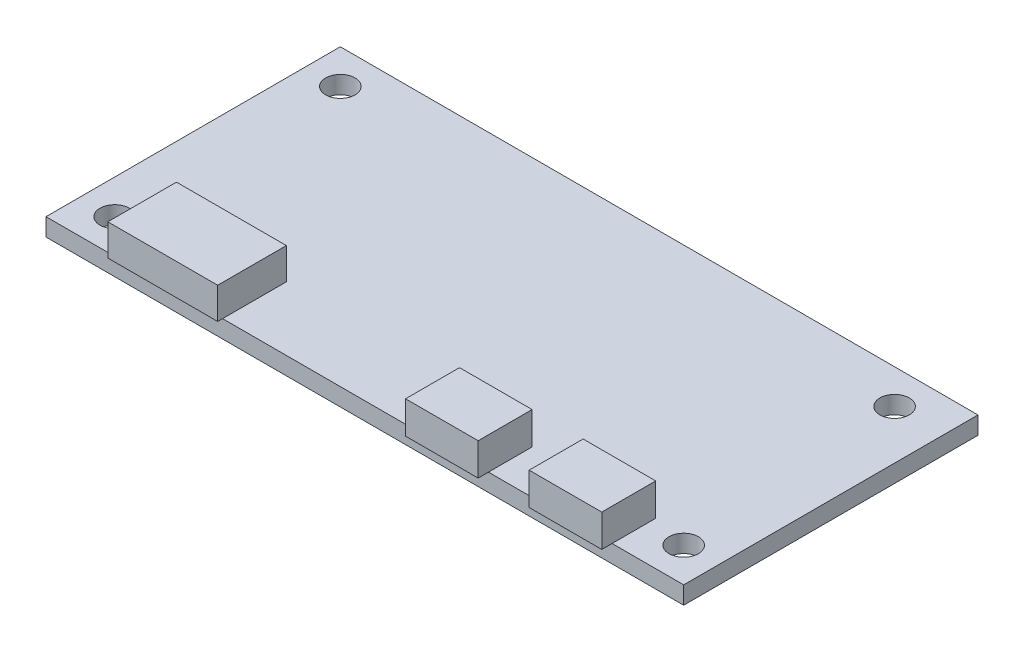
ISO-10303-21;
HEADER;
FILE_DESCRIPTION(('STEP AP214'),'2;1');
FILE_NAME('part.step','',(''),(''),'','','');
FILE_SCHEMA(('AUTOMOTIVE_DESIGN { 1 0 10303 214 1 1 1 1 }'));
ENDSEC;
DATA;
#1=APPLICATION_CONTEXT('core data for automotive mechanical design processes');
#2=APPLICATION_PROTOCOL_DEFINITION('international standard','automotive_design',2000,#1);
#3=PRODUCT_CONTEXT('',#1,'mechanical');
#4=PRODUCT('Part','Part','',(#3));
#5=PRODUCT_RELATED_PRODUCT_CATEGORY('part','',(#4));
#6=PRODUCT_DEFINITION_FORMATION('','',#4);
#7=PRODUCT_DEFINITION_CONTEXT('part definition',#1,'design');
#8=PRODUCT_DEFINITION('design','',#6,#7);
#9=PRODUCT_DEFINITION_SHAPE('','',#8);
#10=(LENGTH_UNIT() NAMED_UNIT(*) SI_UNIT(.MILLI.,.METRE.));
#11=(NAMED_UNIT(*) PLANE_ANGLE_UNIT() SI_UNIT($,.RADIAN.));
#12=(NAMED_UNIT(*) SI_UNIT($,.STERADIAN.) SOLID_ANGLE_UNIT());
#13=UNCERTAINTY_MEASURE_WITH_UNIT(LENGTH_MEASURE(1.E-05),#10,'distance_accuracy_value','');
#14=(GEOMETRIC_REPRESENTATION_CONTEXT(3) GLOBAL_UNCERTAINTY_ASSIGNED_CONTEXT((#13)) GLOBAL_UNIT_ASSIGNED_CONTEXT((#10,
#11,#12)) REPRESENTATION_CONTEXT('',''));
#15=CARTESIAN_POINT('',(0.,0.,0.));
#16=DIRECTION('',(0.,0.,1.));
#17=DIRECTION('',(1.,0.,0.));
#18=AXIS2_PLACEMENT_3D('',#15,#16,#17);
#19=CARTESIAN_POINT('',(0.,0.,0.));
#20=DIRECTION('',(0.,-1.,0.));
#21=DIRECTION('',(0.,0.,-1.));
#22=AXIS2_PLACEMENT_3D('',#19,#20,#21);
#23=PLANE('',#22);
#24=CARTESIAN_POINT('',(32.7195053440274,0.,-13.4961734693878));
#25=DIRECTION('',(0.,1.,0.));
#26=DIRECTION('',(0.,0.,1.));
#27=AXIS2_PLACEMENT_3D('',#24,#25,#26);
#28=CIRCLE('',#27,1.5);
#29=CARTESIAN_POINT('',(32.7195053440274,0.,-11.9961734693877));
#30=VERTEX_POINT('',#29);
#31=EDGE_CURVE('E338',#30,#30,#28,.T.);
#32=ORIENTED_EDGE('',*,*,#31,.F.);
#33=EDGE_LOOP('',(#32));
#34=FACE_BOUND('',#33,.T.);
#35=CARTESIAN_POINT('',(34.2232142857143,0.,9.50382653061225));
#36=DIRECTION('',(0.,1.,0.));
#37=DIRECTION('',(0.,0.,1.));
#38=AXIS2_PLACEMENT_3D('',#35,#36,#37);
#39=CIRCLE('',#38,1.5);
#40=CARTESIAN_POINT('',(34.2232142857143,0.,11.0038265306123));
#41=VERTEX_POINT('',#40);
#42=EDGE_CURVE('E332',#41,#41,#39,.T.);
#43=ORIENTED_EDGE('',*,*,#42,.F.);
#44=EDGE_LOOP('',(#43));
#45=FACE_BOUND('',#44,.T.);
#46=CARTESIAN_POINT('',(-23.7767857142857,0.,9.50382653061225));
#47=DIRECTION('',(0.,1.,0.));
#48=DIRECTION('',(0.,0.,1.));
#49=AXIS2_PLACEMENT_3D('',#46,#47,#48);
#50=CIRCLE('',#49,1.5);
#51=CARTESIAN_POINT('',(-23.7767857142857,0.,11.0038265306122));
#52=VERTEX_POINT('',#51);
#53=EDGE_CURVE('E326',#52,#52,#50,.T.);
#54=ORIENTED_EDGE('',*,*,#53,.F.);
#55=EDGE_LOOP('',(#54));
#56=FACE_BOUND('',#55,.T.);
#57=CARTESIAN_POINT('',(-23.7767857142857,0.,-13.4961734693878));
#58=DIRECTION('',(0.,1.,0.));
#59=DIRECTION('',(0.,0.,1.));
#60=AXIS2_PLACEMENT_3D('',#57,#58,#59);
#61=CIRCLE('',#60,1.5);
#62=CARTESIAN_POINT('',(-23.7767857142857,0.,-11.9961734693877));
#63=VERTEX_POINT('',#62);
#64=EDGE_CURVE('E322',#63,#63,#61,.T.);
#65=ORIENTED_EDGE('',*,*,#64,.F.);
#66=EDGE_LOOP('',(#65));
#67=FACE_BOUND('',#66,.T.);
#68=DIRECTION('',(0.,0.,1.));
#69=VECTOR('',#68,1.);
#70=CARTESIAN_POINT('',(23.0232142857143,0.,8.55382653061225));
#71=LINE('',#70,#69);
#72=CARTESIAN_POINT('',(23.0232142857143,0.,8.55382653061225));
#73=VERTEX_POINT('',#72);
#74=CARTESIAN_POINT('',(23.0232142857143,0.,13.0038265306122));
#75=VERTEX_POINT('',#74);
#76=EDGE_CURVE('E112',#73,#75,#71,.T.);
#77=ORIENTED_EDGE('',*,*,#76,.F.);
#78=DIRECTION('',(-1.,0.,0.));
#79=VECTOR('',#78,1.);
#80=CARTESIAN_POINT('',(23.0232142857143,0.,8.55382653061225));
#81=LINE('',#80,#79);
#82=CARTESIAN_POINT('',(30.4232142857143,0.,8.55382653061225));
#83=VERTEX_POINT('',#82);
#84=EDGE_CURVE('E116',#83,#73,#81,.T.);
#85=ORIENTED_EDGE('',*,*,#84,.F.);
#86=DIRECTION('',(0.,0.,-1.));
#87=VECTOR('',#86,1.);
#88=CARTESIAN_POINT('',(30.4232142857143,0.,8.55382653061225));
#89=LINE('',#88,#87);
#90=CARTESIAN_POINT('',(30.4232142857143,0.,13.0038265306122));
#91=VERTEX_POINT('',#90);
#92=EDGE_CURVE('E385',#91,#83,#89,.T.);
#93=ORIENTED_EDGE('',*,*,#92,.F.);
#94=DIRECTION('',(1.,0.,0.));
#95=VECTOR('',#94,1.);
#96=CARTESIAN_POINT('',(-27.2767857142857,0.,13.0038265306122));
#97=LINE('',#96,#95);
#98=CARTESIAN_POINT('',(37.7232142857143,0.,13.0038265306122));
#99=VERTEX_POINT('',#98);
#100=EDGE_CURVE('E344',#91,#99,#97,.T.);
#101=ORIENTED_EDGE('',*,*,#100,.T.);
#102=DIRECTION('',(0.,0.,1.));
#103=VECTOR('',#102,1.);
#104=CARTESIAN_POINT('',(37.7232142857143,0.,-16.9961734693878));
#105=LINE('',#104,#103);
#106=CARTESIAN_POINT('',(37.7232142857143,0.,-16.9961734693878));
#107=VERTEX_POINT('',#106);
#108=EDGE_CURVE('E361',#107,#99,#105,.T.);
#109=ORIENTED_EDGE('',*,*,#108,.F.);
#110=DIRECTION('',(1.,0.,0.));
#111=VECTOR('',#110,1.);
#112=CARTESIAN_POINT('',(-27.2767857142857,0.,-16.9961734693878));
#113=LINE('',#112,#111);
#114=CARTESIAN_POINT('',(-27.2767857142857,0.,-16.9961734693878));
#115=VERTEX_POINT('',#114);
#116=EDGE_CURVE('E365',#115,#107,#113,.T.);
#117=ORIENTED_EDGE('',*,*,#116,.F.);
#118=DIRECTION('',(0.,0.,1.));
#119=VECTOR('',#118,1.);
#120=CARTESIAN_POINT('',(-27.2767857142857,0.,-16.9961734693878));
#121=LINE('',#120,#119);
#122=CARTESIAN_POINT('',(-27.2767857142857,0.,13.0038265306122));
#123=VERTEX_POINT('',#122);
#124=EDGE_CURVE('E351',#115,#123,#121,.T.);
#125=ORIENTED_EDGE('',*,*,#124,.T.);
#126=CARTESIAN_POINT('',(-20.4767857142857,0.,13.0038265306122));
#127=VERTEX_POINT('',#126);
#128=EDGE_CURVE('E358',#123,#127,#97,.T.);
#129=ORIENTED_EDGE('',*,*,#128,.T.);
#130=DIRECTION('',(0.,0.,1.));
#131=VECTOR('',#130,1.);
#132=CARTESIAN_POINT('',(-20.4767857142857,0.,6.50382653061225));
#133=LINE('',#132,#131);
#134=CARTESIAN_POINT('',(-20.4767857142857,0.,6.50382653061225));
#135=VERTEX_POINT('',#134);
#136=EDGE_CURVE('E303',#135,#127,#133,.T.);
#137=ORIENTED_EDGE('',*,*,#136,.F.);
#138=DIRECTION('',(-1.,0.,0.));
#139=VECTOR('',#138,1.);
#140=CARTESIAN_POINT('',(-20.4767857142857,0.,6.50382653061225));
#141=LINE('',#140,#139);
#142=CARTESIAN_POINT('',(-9.27678571428569,0.,6.50382653061225));
#143=VERTEX_POINT('',#142);
#144=EDGE_CURVE('E296',#143,#135,#141,.T.);
#145=ORIENTED_EDGE('',*,*,#144,.F.);
#146=DIRECTION('',(0.,0.,-1.));
#147=VECTOR('',#146,1.);
#148=CARTESIAN_POINT('',(-9.27678571428569,0.,6.50382653061225));
#149=LINE('',#148,#147);
#150=CARTESIAN_POINT('',(-9.27678571428569,0.,13.0038265306122));
#151=VERTEX_POINT('',#150);
#152=EDGE_CURVE('E12',#151,#143,#149,.T.);
#153=ORIENTED_EDGE('',*,*,#152,.F.);
#154=CARTESIAN_POINT('',(10.4232142857143,0.,13.0038265306122));
#155=VERTEX_POINT('',#154);
#156=EDGE_CURVE('E395',#151,#155,#97,.T.);
#157=ORIENTED_EDGE('',*,*,#156,.T.);
#158=DIRECTION('',(0.,0.,1.));
#159=VECTOR('',#158,1.);
#160=CARTESIAN_POINT('',(10.4232142857143,0.,8.55382653061225));
#161=LINE('',#160,#159);
#162=CARTESIAN_POINT('',(10.4232142857143,0.,8.55382653061225));
#163=VERTEX_POINT('',#162);
#164=EDGE_CURVE('E254',#163,#155,#161,.T.);
#165=ORIENTED_EDGE('',*,*,#164,.F.);
#166=DIRECTION('',(-1.,0.,0.));
#167=VECTOR('',#166,1.);
#168=CARTESIAN_POINT('',(10.4232142857143,0.,8.55382653061225));
#169=LINE('',#168,#167);
#170=CARTESIAN_POINT('',(17.8232142857143,0.,8.55382653061225));
#171=VERTEX_POINT('',#170);
#172=EDGE_CURVE('E264',#171,#163,#169,.T.);
#173=ORIENTED_EDGE('',*,*,#172,.F.);
#174=DIRECTION('',(0.,0.,-1.));
#175=VECTOR('',#174,1.);
#176=CARTESIAN_POINT('',(17.8232142857143,0.,8.55382653061225));
#177=LINE('',#176,#175);
#178=CARTESIAN_POINT('',(17.8232142857143,0.,13.0038265306122));
#179=VERTEX_POINT('',#178);
#180=EDGE_CURVE('E274',#179,#171,#177,.T.);
#181=ORIENTED_EDGE('',*,*,#180,.F.);
#182=EDGE_CURVE('E388',#179,#75,#97,.T.);
#183=ORIENTED_EDGE('',*,*,#182,.T.);
#184=EDGE_LOOP('',(#77,#85,#93,#101,#109,#117,#125,#129,#137,#145,#153,#157,#165,#173,#181,#183));
#185=FACE_BOUND('',#184,.T.);
#186=ADVANCED_FACE('F94',(#34,#45,#56,#67,#185),#23,.F.);
#187=CARTESIAN_POINT('',(-27.2767857142857,-1.8,13.0038265306122));
#188=DIRECTION('',(0.,0.,1.));
#189=DIRECTION('',(1.,0.,0.));
#190=AXIS2_PLACEMENT_3D('',#187,#188,#189);
#191=PLANE('',#190);
#192=ORIENTED_EDGE('',*,*,#128,.F.);
#193=DIRECTION('',(0.,1.,0.));
#194=VECTOR('',#193,1.);
#195=CARTESIAN_POINT('',(-27.2767857142857,-1.8,13.0038265306122));
#196=LINE('',#195,#194);
#197=CARTESIAN_POINT('',(-27.2767857142857,-1.8,13.0038265306122));
#198=VERTEX_POINT('',#197);
#199=EDGE_CURVE('E103',#198,#123,#196,.T.);
#200=ORIENTED_EDGE('',*,*,#199,.F.);
#201=DIRECTION('',(1.,0.,0.));
#202=VECTOR('',#201,1.);
#203=CARTESIAN_POINT('',(-27.2767857142857,-1.8,13.0038265306122));
#204=LINE('',#203,#202);
#205=CARTESIAN_POINT('',(37.7232142857143,-1.8,13.0038265306122));
#206=VERTEX_POINT('',#205);
#207=EDGE_CURVE('E347',#198,#206,#204,.T.);
#208=ORIENTED_EDGE('',*,*,#207,.T.);
#209=DIRECTION('',(0.,1.,0.));
#210=VECTOR('',#209,1.);
#211=CARTESIAN_POINT('',(37.7232142857143,-1.8,13.0038265306122));
#212=LINE('',#211,#210);
#213=EDGE_CURVE('E98',#206,#99,#212,.T.);
#214=ORIENTED_EDGE('',*,*,#213,.T.);
#215=ORIENTED_EDGE('',*,*,#100,.F.);
#216=EDGE_CURVE('E387',#75,#91,#97,.T.);
#217=ORIENTED_EDGE('',*,*,#216,.F.);
#218=ORIENTED_EDGE('',*,*,#182,.F.);
#219=EDGE_CURVE('E392',#155,#179,#97,.T.);
#220=ORIENTED_EDGE('',*,*,#219,.F.);
#221=ORIENTED_EDGE('',*,*,#156,.F.);
#222=EDGE_CURVE('E362',#127,#151,#97,.T.);
#223=ORIENTED_EDGE('',*,*,#222,.F.);
#224=EDGE_LOOP('',(#192,#200,#208,#214,#215,#217,#218,#220,#221,#223));
#225=FACE_BOUND('',#224,.T.);
#226=ADVANCED_FACE('F96',(#225),#191,.T.);
#227=CARTESIAN_POINT('',(-27.2767857142857,-1.8,-16.9961734693878));
#228=DIRECTION('',(-1.,0.,0.));
#229=DIRECTION('',(0.,0.,1.));
#230=AXIS2_PLACEMENT_3D('',#227,#228,#229);
#231=PLANE('',#230);
#232=ORIENTED_EDGE('',*,*,#124,.F.);
#233=DIRECTION('',(0.,1.,0.));
#234=VECTOR('',#233,1.);
#235=CARTESIAN_POINT('',(-27.2767857142857,-1.8,-16.9961734693878));
#236=LINE('',#235,#234);
#237=CARTESIAN_POINT('',(-27.2767857142857,-1.8,-16.9961734693878));
#238=VERTEX_POINT('',#237);
#239=EDGE_CURVE('E370',#238,#115,#236,.T.);
#240=ORIENTED_EDGE('',*,*,#239,.F.);
#241=DIRECTION('',(0.,0.,1.));
#242=VECTOR('',#241,1.);
#243=CARTESIAN_POINT('',(-27.2767857142857,-1.8,-16.9961734693878));
#244=LINE('',#243,#242);
#245=EDGE_CURVE('E355',#238,#198,#244,.T.);
#246=ORIENTED_EDGE('',*,*,#245,.T.);
#247=ORIENTED_EDGE('',*,*,#199,.T.);
#248=EDGE_LOOP('',(#232,#240,#246,#247));
#249=FACE_BOUND('',#248,.T.);
#250=ADVANCED_FACE('F442',(#249),#231,.T.);
#251=CARTESIAN_POINT('',(-27.2767857142857,-1.8,-16.9961734693878));
#252=DIRECTION('',(0.,0.,1.));
#253=DIRECTION('',(1.,0.,0.));
#254=AXIS2_PLACEMENT_3D('',#251,#252,#253);
#255=PLANE('',#254);
#256=ORIENTED_EDGE('',*,*,#116,.T.);
#257=DIRECTION('',(0.,1.,0.));
#258=VECTOR('',#257,1.);
#259=CARTESIAN_POINT('',(37.7232142857143,-1.8,-16.9961734693878));
#260=LINE('',#259,#258);
#261=CARTESIAN_POINT('',(37.7232142857143,-1.8,-16.9961734693878));
#262=VERTEX_POINT('',#261);
#263=EDGE_CURVE('E371',#262,#107,#260,.T.);
#264=ORIENTED_EDGE('',*,*,#263,.F.);
#265=DIRECTION('',(1.,0.,0.));
#266=VECTOR('',#265,1.);
#267=CARTESIAN_POINT('',(-27.2767857142857,-1.8,-16.9961734693878));
#268=LINE('',#267,#266);
#269=EDGE_CURVE('E353',#238,#262,#268,.T.);
#270=ORIENTED_EDGE('',*,*,#269,.F.);
#271=ORIENTED_EDGE('',*,*,#239,.T.);
#272=EDGE_LOOP('',(#256,#264,#270,#271));
#273=FACE_BOUND('',#272,.T.);
#274=ADVANCED_FACE('F451',(#273),#255,.F.);
#275=CARTESIAN_POINT('',(37.7232142857143,-1.8,-16.9961734693878));
#276=DIRECTION('',(-1.,0.,0.));
#277=DIRECTION('',(0.,0.,1.));
#278=AXIS2_PLACEMENT_3D('',#275,#276,#277);
#279=PLANE('',#278);
#280=ORIENTED_EDGE('',*,*,#108,.T.);
#281=ORIENTED_EDGE('',*,*,#213,.F.);
#282=DIRECTION('',(0.,0.,1.));
#283=VECTOR('',#282,1.);
#284=CARTESIAN_POINT('',(37.7232142857143,-1.8,-16.9961734693878));
#285=LINE('',#284,#283);
#286=EDGE_CURVE('E350',#262,#206,#285,.T.);
#287=ORIENTED_EDGE('',*,*,#286,.F.);
#288=ORIENTED_EDGE('',*,*,#263,.T.);
#289=EDGE_LOOP('',(#280,#281,#287,#288));
#290=FACE_BOUND('',#289,.T.);
#291=ADVANCED_FACE('F382',(#290),#279,.F.);
#292=CARTESIAN_POINT('',(0.,-1.8,0.));
#293=DIRECTION('',(0.,-1.,0.));
#294=DIRECTION('',(0.,0.,-1.));
#295=AXIS2_PLACEMENT_3D('',#292,#293,#294);
#296=PLANE('',#295);
#297=CARTESIAN_POINT('',(-23.7767857142857,-1.8,-13.4961734693878));
#298=DIRECTION('',(0.,1.,0.));
#299=DIRECTION('',(0.,0.,1.));
#300=AXIS2_PLACEMENT_3D('',#297,#298,#299);
#301=CIRCLE('',#300,1.5);
#302=CARTESIAN_POINT('',(-23.7767857142857,-1.8,-11.9961734693877));
#303=VERTEX_POINT('',#302);
#304=EDGE_CURVE('E323',#303,#303,#301,.T.);
#305=ORIENTED_EDGE('',*,*,#304,.T.);
#306=EDGE_LOOP('',(#305));
#307=FACE_BOUND('',#306,.T.);
#308=CARTESIAN_POINT('',(-23.7767857142857,-1.8,9.50382653061225));
#309=DIRECTION('',(0.,1.,0.));
#310=DIRECTION('',(0.,0.,1.));
#311=AXIS2_PLACEMENT_3D('',#308,#309,#310);
#312=CIRCLE('',#311,1.5);
#313=CARTESIAN_POINT('',(-23.7767857142857,-1.8,11.0038265306122));
#314=VERTEX_POINT('',#313);
#315=EDGE_CURVE('E329',#314,#314,#312,.T.);
#316=ORIENTED_EDGE('',*,*,#315,.T.);
#317=EDGE_LOOP('',(#316));
#318=FACE_BOUND('',#317,.T.);
#319=CARTESIAN_POINT('',(34.2232142857143,-1.8,9.50382653061225));
#320=DIRECTION('',(0.,1.,0.));
#321=DIRECTION('',(0.,0.,1.));
#322=AXIS2_PLACEMENT_3D('',#319,#320,#321);
#323=CIRCLE('',#322,1.5);
#324=CARTESIAN_POINT('',(34.2232142857143,-1.8,11.0038265306123));
#325=VERTEX_POINT('',#324);
#326=EDGE_CURVE('E335',#325,#325,#323,.T.);
#327=ORIENTED_EDGE('',*,*,#326,.T.);
#328=EDGE_LOOP('',(#327));
#329=FACE_BOUND('',#328,.T.);
#330=CARTESIAN_POINT('',(32.7195053440274,-1.8,-13.4961734693878));
#331=DIRECTION('',(0.,1.,0.));
#332=DIRECTION('',(0.,0.,1.));
#333=AXIS2_PLACEMENT_3D('',#330,#331,#332);
#334=CIRCLE('',#333,1.5);
#335=CARTESIAN_POINT('',(32.7195053440274,-1.8,-11.9961734693877));
#336=VERTEX_POINT('',#335);
#337=EDGE_CURVE('E341',#336,#336,#334,.T.);
#338=ORIENTED_EDGE('',*,*,#337,.T.);
#339=EDGE_LOOP('',(#338));
#340=FACE_BOUND('',#339,.T.);
#341=ORIENTED_EDGE('',*,*,#207,.F.);
#342=ORIENTED_EDGE('',*,*,#245,.F.);
#343=ORIENTED_EDGE('',*,*,#269,.T.);
#344=ORIENTED_EDGE('',*,*,#286,.T.);
#345=EDGE_LOOP('',(#341,#342,#343,#344));
#346=FACE_BOUND('',#345,.T.);
#347=ADVANCED_FACE('F447',(#307,#318,#329,#340,#346),#296,.T.);
#348=CARTESIAN_POINT('',(32.7195053440274,-1.8,-13.4961734693878));
#349=DIRECTION('',(0.,1.,0.));
#350=DIRECTION('',(0.,0.,1.));
#351=AXIS2_PLACEMENT_3D('',#348,#349,#350);
#352=CYLINDRICAL_SURFACE('',#351,1.5);
#353=ORIENTED_EDGE('',*,*,#337,.F.);
#354=EDGE_LOOP('',(#353));
#355=FACE_BOUND('',#354,.T.);
#356=ORIENTED_EDGE('',*,*,#31,.T.);
#357=EDGE_LOOP('',(#356));
#358=FACE_BOUND('',#357,.T.);
#359=ADVANCED_FACE('F459',(#355,#358),#352,.F.);
#360=CARTESIAN_POINT('',(34.2232142857143,-1.8,9.50382653061225));
#361=DIRECTION('',(0.,1.,0.));
#362=DIRECTION('',(0.,0.,1.));
#363=AXIS2_PLACEMENT_3D('',#360,#361,#362);
#364=CYLINDRICAL_SURFACE('',#363,1.5);
#365=ORIENTED_EDGE('',*,*,#326,.F.);
#366=EDGE_LOOP('',(#365));
#367=FACE_BOUND('',#366,.T.);
#368=ORIENTED_EDGE('',*,*,#42,.T.);
#369=EDGE_LOOP('',(#368));
#370=FACE_BOUND('',#369,.T.);
#371=ADVANCED_FACE('F464',(#367,#370),#364,.F.);
#372=CARTESIAN_POINT('',(-23.7767857142857,-1.8,9.50382653061225));
#373=DIRECTION('',(0.,1.,0.));
#374=DIRECTION('',(0.,0.,1.));
#375=AXIS2_PLACEMENT_3D('',#372,#373,#374);
#376=CYLINDRICAL_SURFACE('',#375,1.5);
#377=ORIENTED_EDGE('',*,*,#315,.F.);
#378=EDGE_LOOP('',(#377));
#379=FACE_BOUND('',#378,.T.);
#380=ORIENTED_EDGE('',*,*,#53,.T.);
#381=EDGE_LOOP('',(#380));
#382=FACE_BOUND('',#381,.T.);
#383=ADVANCED_FACE('F480',(#379,#382),#376,.F.);
#384=CARTESIAN_POINT('',(-23.7767857142857,-1.8,-13.4961734693878));
#385=DIRECTION('',(0.,1.,0.));
#386=DIRECTION('',(0.,0.,1.));
#387=AXIS2_PLACEMENT_3D('',#384,#385,#386);
#388=CYLINDRICAL_SURFACE('',#387,1.5);
#389=ORIENTED_EDGE('',*,*,#304,.F.);
#390=EDGE_LOOP('',(#389));
#391=FACE_BOUND('',#390,.T.);
#392=ORIENTED_EDGE('',*,*,#64,.T.);
#393=EDGE_LOOP('',(#392));
#394=FACE_BOUND('',#393,.T.);
#395=ADVANCED_FACE('F488',(#391,#394),#388,.F.);
#396=CARTESIAN_POINT('',(0.,0.,0.));
#397=DIRECTION('',(0.,1.,0.));
#398=DIRECTION('',(0.,0.,1.));
#399=AXIS2_PLACEMENT_3D('',#396,#397,#398);
#400=PLANE('',#399);
#401=CARTESIAN_POINT('',(-20.4767857142857,0.,13.5038265306122));
#402=VERTEX_POINT('',#401);
#403=EDGE_CURVE('E291',#127,#402,#133,.T.);
#404=ORIENTED_EDGE('',*,*,#403,.F.);
#405=ORIENTED_EDGE('',*,*,#222,.T.);
#406=CARTESIAN_POINT('',(-9.27678571428569,0.,13.5038265306122));
#407=VERTEX_POINT('',#406);
#408=EDGE_CURVE('E105',#407,#151,#149,.T.);
#409=ORIENTED_EDGE('',*,*,#408,.F.);
#410=DIRECTION('',(1.,0.,0.));
#411=VECTOR('',#410,1.);
#412=CARTESIAN_POINT('',(-20.4767857142857,0.,13.5038265306122));
#413=LINE('',#412,#411);
#414=EDGE_CURVE('E306',#402,#407,#413,.T.);
#415=ORIENTED_EDGE('',*,*,#414,.F.);
#416=EDGE_LOOP('',(#404,#405,#409,#415));
#417=FACE_BOUND('',#416,.T.);
#418=ADVANCED_FACE('F405',(#417),#400,.F.);
#419=CARTESIAN_POINT('',(-20.4767857142857,3.2,6.50382653061225));
#420=DIRECTION('',(1.,0.,0.));
#421=DIRECTION('',(0.,0.,-1.));
#422=AXIS2_PLACEMENT_3D('',#419,#420,#421);
#423=PLANE('',#422);
#424=ORIENTED_EDGE('',*,*,#136,.T.);
#425=ORIENTED_EDGE('',*,*,#403,.T.);
#426=DIRECTION('',(0.,-1.,0.));
#427=VECTOR('',#426,1.);
#428=CARTESIAN_POINT('',(-20.4767857142857,3.2,13.5038265306122));
#429=LINE('',#428,#427);
#430=CARTESIAN_POINT('',(-20.4767857142857,3.2,13.5038265306122));
#431=VERTEX_POINT('',#430);
#432=EDGE_CURVE('E319',#431,#402,#429,.T.);
#433=ORIENTED_EDGE('',*,*,#432,.F.);
#434=DIRECTION('',(0.,0.,1.));
#435=VECTOR('',#434,1.);
#436=CARTESIAN_POINT('',(-20.4767857142857,3.2,6.50382653061225));
#437=LINE('',#436,#435);
#438=CARTESIAN_POINT('',(-20.4767857142857,3.2,6.50382653061225));
#439=VERTEX_POINT('',#438);
#440=EDGE_CURVE('E292',#439,#431,#437,.T.);
#441=ORIENTED_EDGE('',*,*,#440,.F.);
#442=DIRECTION('',(0.,-1.,0.));
#443=VECTOR('',#442,1.);
#444=CARTESIAN_POINT('',(-20.4767857142857,3.2,6.50382653061225));
#445=LINE('',#444,#443);
#446=EDGE_CURVE('E302',#439,#135,#445,.T.);
#447=ORIENTED_EDGE('',*,*,#446,.T.);
#448=EDGE_LOOP('',(#424,#425,#433,#441,#447));
#449=FACE_BOUND('',#448,.T.);
#450=ADVANCED_FACE('F417',(#449),#423,.F.);
#451=CARTESIAN_POINT('',(-20.4767857142857,3.2,13.5038265306122));
#452=DIRECTION('',(0.,0.,-1.));
#453=DIRECTION('',(-1.,0.,0.));
#454=AXIS2_PLACEMENT_3D('',#451,#452,#453);
#455=PLANE('',#454);
#456=ORIENTED_EDGE('',*,*,#414,.T.);
#457=DIRECTION('',(0.,-1.,0.));
#458=VECTOR('',#457,1.);
#459=CARTESIAN_POINT('',(-9.27678571428569,3.2,13.5038265306122));
#460=LINE('',#459,#458);
#461=CARTESIAN_POINT('',(-9.27678571428569,3.2,13.5038265306122));
#462=VERTEX_POINT('',#461);
#463=EDGE_CURVE('E316',#462,#407,#460,.T.);
#464=ORIENTED_EDGE('',*,*,#463,.F.);
#465=DIRECTION('',(1.,0.,0.));
#466=VECTOR('',#465,1.);
#467=CARTESIAN_POINT('',(-20.4767857142857,3.2,13.5038265306122));
#468=LINE('',#467,#466);
#469=EDGE_CURVE('E295',#431,#462,#468,.T.);
#470=ORIENTED_EDGE('',*,*,#469,.F.);
#471=ORIENTED_EDGE('',*,*,#432,.T.);
#472=EDGE_LOOP('',(#456,#464,#470,#471));
#473=FACE_BOUND('',#472,.T.);
#474=ADVANCED_FACE('F413',(#473),#455,.F.);
#475=CARTESIAN_POINT('',(-9.27678571428569,3.2,6.50382653061225));
#476=DIRECTION('',(-1.,0.,0.));
#477=DIRECTION('',(0.,0.,1.));
#478=AXIS2_PLACEMENT_3D('',#475,#476,#477);
#479=PLANE('',#478);
#480=ORIENTED_EDGE('',*,*,#408,.T.);
#481=ORIENTED_EDGE('',*,*,#152,.T.);
#482=DIRECTION('',(0.,-1.,0.));
#483=VECTOR('',#482,1.);
#484=CARTESIAN_POINT('',(-9.27678571428569,3.2,6.50382653061225));
#485=LINE('',#484,#483);
#486=CARTESIAN_POINT('',(-9.27678571428569,3.2,6.50382653061225));
#487=VERTEX_POINT('',#486);
#488=EDGE_CURVE('E313',#487,#143,#485,.T.);
#489=ORIENTED_EDGE('',*,*,#488,.F.);
#490=DIRECTION('',(0.,0.,-1.));
#491=VECTOR('',#490,1.);
#492=CARTESIAN_POINT('',(-9.27678571428569,3.2,6.50382653061225));
#493=LINE('',#492,#491);
#494=EDGE_CURVE('E298',#462,#487,#493,.T.);
#495=ORIENTED_EDGE('',*,*,#494,.F.);
#496=ORIENTED_EDGE('',*,*,#463,.T.);
#497=EDGE_LOOP('',(#480,#481,#489,#495,#496));
#498=FACE_BOUND('',#497,.T.);
#499=ADVANCED_FACE('F408',(#498),#479,.F.);
#500=CARTESIAN_POINT('',(-20.4767857142857,3.2,6.50382653061225));
#501=DIRECTION('',(0.,0.,1.));
#502=DIRECTION('',(1.,0.,0.));
#503=AXIS2_PLACEMENT_3D('',#500,#501,#502);
#504=PLANE('',#503);
#505=ORIENTED_EDGE('',*,*,#144,.T.);
#506=ORIENTED_EDGE('',*,*,#446,.F.);
#507=DIRECTION('',(-1.,0.,0.));
#508=VECTOR('',#507,1.);
#509=CARTESIAN_POINT('',(-20.4767857142857,3.2,6.50382653061225));
#510=LINE('',#509,#508);
#511=EDGE_CURVE('E300',#487,#439,#510,.T.);
#512=ORIENTED_EDGE('',*,*,#511,.F.);
#513=ORIENTED_EDGE('',*,*,#488,.T.);
#514=EDGE_LOOP('',(#505,#506,#512,#513));
#515=FACE_BOUND('',#514,.T.);
#516=ADVANCED_FACE('F420',(#515),#504,.F.);
#517=CARTESIAN_POINT('',(0.,3.2,0.));
#518=DIRECTION('',(0.,1.,0.));
#519=DIRECTION('',(0.,0.,1.));
#520=AXIS2_PLACEMENT_3D('',#517,#518,#519);
#521=PLANE('',#520);
#522=ORIENTED_EDGE('',*,*,#440,.T.);
#523=ORIENTED_EDGE('',*,*,#469,.T.);
#524=ORIENTED_EDGE('',*,*,#494,.T.);
#525=ORIENTED_EDGE('',*,*,#511,.T.);
#526=EDGE_LOOP('',(#522,#523,#524,#525));
#527=FACE_BOUND('',#526,.T.);
#528=ADVANCED_FACE('F423',(#527),#521,.T.);
#529=CARTESIAN_POINT('',(10.4232142857143,3.3,8.55382653061225));
#530=DIRECTION('',(1.,0.,0.));
#531=DIRECTION('',(0.,0.,-1.));
#532=AXIS2_PLACEMENT_3D('',#529,#530,#531);
#533=PLANE('',#532);
#534=ORIENTED_EDGE('',*,*,#164,.T.);
#535=CARTESIAN_POINT('',(10.4232142857143,0.,14.0538265306123));
#536=VERTEX_POINT('',#535);
#537=EDGE_CURVE('E252',#155,#536,#161,.T.);
#538=ORIENTED_EDGE('',*,*,#537,.T.);
#539=DIRECTION('',(0.,-1.,0.));
#540=VECTOR('',#539,1.);
#541=CARTESIAN_POINT('',(10.4232142857143,3.3,14.0538265306123));
#542=LINE('',#541,#540);
#543=CARTESIAN_POINT('',(10.4232142857143,3.3,14.0538265306123));
#544=VERTEX_POINT('',#543);
#545=EDGE_CURVE('E288',#544,#536,#542,.T.);
#546=ORIENTED_EDGE('',*,*,#545,.F.);
#547=DIRECTION('',(0.,0.,1.));
#548=VECTOR('',#547,1.);
#549=CARTESIAN_POINT('',(10.4232142857143,3.3,8.55382653061225));
#550=LINE('',#549,#548);
#551=CARTESIAN_POINT('',(10.4232142857143,3.3,8.55382653061225));
#552=VERTEX_POINT('',#551);
#553=EDGE_CURVE('E260',#552,#544,#550,.T.);
#554=ORIENTED_EDGE('',*,*,#553,.F.);
#555=DIRECTION('',(0.,-1.,0.));
#556=VECTOR('',#555,1.);
#557=CARTESIAN_POINT('',(10.4232142857143,3.3,8.55382653061225));
#558=LINE('',#557,#556);
#559=EDGE_CURVE('E269',#552,#163,#558,.T.);
#560=ORIENTED_EDGE('',*,*,#559,.T.);
#561=EDGE_LOOP('',(#534,#538,#546,#554,#560));
#562=FACE_BOUND('',#561,.T.);
#563=ADVANCED_FACE('F425',(#562),#533,.F.);
#564=CARTESIAN_POINT('',(10.4232142857143,3.3,14.0538265306123));
#565=DIRECTION('',(0.,0.,-1.));
#566=DIRECTION('',(-1.,0.,0.));
#567=AXIS2_PLACEMENT_3D('',#564,#565,#566);
#568=PLANE('',#567);
#569=DIRECTION('',(1.,0.,0.));
#570=VECTOR('',#569,1.);
#571=CARTESIAN_POINT('',(10.4232142857143,0.,14.0538265306123));
#572=LINE('',#571,#570);
#573=CARTESIAN_POINT('',(17.8232142857143,0.,14.0538265306123));
#574=VERTEX_POINT('',#573);
#575=EDGE_CURVE('E272',#536,#574,#572,.T.);
#576=ORIENTED_EDGE('',*,*,#575,.T.);
#577=DIRECTION('',(0.,-1.,0.));
#578=VECTOR('',#577,1.);
#579=CARTESIAN_POINT('',(17.8232142857143,3.3,14.0538265306123));
#580=LINE('',#579,#578);
#581=CARTESIAN_POINT('',(17.8232142857143,3.3,14.0538265306123));
#582=VERTEX_POINT('',#581);
#583=EDGE_CURVE('E285',#582,#574,#580,.T.);
#584=ORIENTED_EDGE('',*,*,#583,.F.);
#585=DIRECTION('',(1.,0.,0.));
#586=VECTOR('',#585,1.);
#587=CARTESIAN_POINT('',(10.4232142857143,3.3,14.0538265306123));
#588=LINE('',#587,#586);
#589=EDGE_CURVE('E263',#544,#582,#588,.T.);
#590=ORIENTED_EDGE('',*,*,#589,.F.);
#591=ORIENTED_EDGE('',*,*,#545,.T.);
#592=EDGE_LOOP('',(#576,#584,#590,#591));
#593=FACE_BOUND('',#592,.T.);
#594=ADVANCED_FACE('F431',(#593),#568,.F.);
#595=CARTESIAN_POINT('',(17.8232142857143,3.3,8.55382653061225));
#596=DIRECTION('',(-1.,0.,0.));
#597=DIRECTION('',(0.,0.,1.));
#598=AXIS2_PLACEMENT_3D('',#595,#596,#597);
#599=PLANE('',#598);
#600=EDGE_CURVE('E275',#574,#179,#177,.T.);
#601=ORIENTED_EDGE('',*,*,#600,.T.);
#602=ORIENTED_EDGE('',*,*,#180,.T.);
#603=DIRECTION('',(0.,-1.,0.));
#604=VECTOR('',#603,1.);
#605=CARTESIAN_POINT('',(17.8232142857143,3.3,8.55382653061225));
#606=LINE('',#605,#604);
#607=CARTESIAN_POINT('',(17.8232142857143,3.3,8.55382653061225));
#608=VERTEX_POINT('',#607);
#609=EDGE_CURVE('E282',#608,#171,#606,.T.);
#610=ORIENTED_EDGE('',*,*,#609,.F.);
#611=DIRECTION('',(0.,0.,-1.));
#612=VECTOR('',#611,1.);
#613=CARTESIAN_POINT('',(17.8232142857143,3.3,8.55382653061225));
#614=LINE('',#613,#612);
#615=EDGE_CURVE('E266',#582,#608,#614,.T.);
#616=ORIENTED_EDGE('',*,*,#615,.F.);
#617=ORIENTED_EDGE('',*,*,#583,.T.);
#618=EDGE_LOOP('',(#601,#602,#610,#616,#617));
#619=FACE_BOUND('',#618,.T.);
#620=ADVANCED_FACE('F542',(#619),#599,.F.);
#621=CARTESIAN_POINT('',(10.4232142857143,3.3,8.55382653061225));
#622=DIRECTION('',(0.,0.,1.));
#623=DIRECTION('',(1.,0.,0.));
#624=AXIS2_PLACEMENT_3D('',#621,#622,#623);
#625=PLANE('',#624);
#626=ORIENTED_EDGE('',*,*,#172,.T.);
#627=ORIENTED_EDGE('',*,*,#559,.F.);
#628=DIRECTION('',(-1.,0.,0.));
#629=VECTOR('',#628,1.);
#630=CARTESIAN_POINT('',(10.4232142857143,3.3,8.55382653061225));
#631=LINE('',#630,#629);
#632=EDGE_CURVE('E268',#608,#552,#631,.T.);
#633=ORIENTED_EDGE('',*,*,#632,.F.);
#634=ORIENTED_EDGE('',*,*,#609,.T.);
#635=EDGE_LOOP('',(#626,#627,#633,#634));
#636=FACE_BOUND('',#635,.T.);
#637=ADVANCED_FACE('F552',(#636),#625,.F.);
#638=CARTESIAN_POINT('',(0.,3.3,0.));
#639=DIRECTION('',(0.,1.,0.));
#640=DIRECTION('',(0.,0.,1.));
#641=AXIS2_PLACEMENT_3D('',#638,#639,#640);
#642=PLANE('',#641);
#643=ORIENTED_EDGE('',*,*,#553,.T.);
#644=ORIENTED_EDGE('',*,*,#589,.T.);
#645=ORIENTED_EDGE('',*,*,#615,.T.);
#646=ORIENTED_EDGE('',*,*,#632,.T.);
#647=EDGE_LOOP('',(#643,#644,#645,#646));
#648=FACE_BOUND('',#647,.T.);
#649=ADVANCED_FACE('F562',(#648),#642,.T.);
#650=CARTESIAN_POINT('',(0.,0.,0.));
#651=DIRECTION('',(0.,1.,0.));
#652=DIRECTION('',(0.,0.,1.));
#653=AXIS2_PLACEMENT_3D('',#650,#651,#652);
#654=PLANE('',#653);
#655=ORIENTED_EDGE('',*,*,#219,.T.);
#656=ORIENTED_EDGE('',*,*,#600,.F.);
#657=ORIENTED_EDGE('',*,*,#575,.F.);
#658=ORIENTED_EDGE('',*,*,#537,.F.);
#659=EDGE_LOOP('',(#655,#656,#657,#658));
#660=FACE_BOUND('',#659,.T.);
#661=ADVANCED_FACE('F572',(#660),#654,.F.);
#662=CARTESIAN_POINT('',(23.0232142857143,3.3,8.55382653061225));
#663=DIRECTION('',(1.,0.,0.));
#664=DIRECTION('',(0.,0.,-1.));
#665=AXIS2_PLACEMENT_3D('',#662,#663,#664);
#666=PLANE('',#665);
#667=ORIENTED_EDGE('',*,*,#76,.T.);
#668=CARTESIAN_POINT('',(23.0232142857143,0.,14.0538265306123));
#669=VERTEX_POINT('',#668);
#670=EDGE_CURVE('E250',#75,#669,#71,.T.);
#671=ORIENTED_EDGE('',*,*,#670,.T.);
#672=DIRECTION('',(0.,-1.,0.));
#673=VECTOR('',#672,1.);
#674=CARTESIAN_POINT('',(23.0232142857143,3.3,14.0538265306123));
#675=LINE('',#674,#673);
#676=CARTESIAN_POINT('',(23.0232142857143,3.3,14.0538265306123));
#677=VERTEX_POINT('',#676);
#678=EDGE_CURVE('E232',#677,#669,#675,.T.);
#679=ORIENTED_EDGE('',*,*,#678,.F.);
#680=DIRECTION('',(0.,0.,1.));
#681=VECTOR('',#680,1.);
#682=CARTESIAN_POINT('',(23.0232142857143,3.3,8.55382653061225));
#683=LINE('',#682,#681);
#684=CARTESIAN_POINT('',(23.0232142857143,3.3,8.55382653061225));
#685=VERTEX_POINT('',#684);
#686=EDGE_CURVE('E238',#685,#677,#683,.T.);
#687=ORIENTED_EDGE('',*,*,#686,.F.);
#688=DIRECTION('',(0.,-1.,0.));
#689=VECTOR('',#688,1.);
#690=CARTESIAN_POINT('',(23.0232142857143,3.3,8.55382653061225));
#691=LINE('',#690,#689);
#692=EDGE_CURVE('E639',#685,#73,#691,.T.);
#693=ORIENTED_EDGE('',*,*,#692,.T.);
#694=EDGE_LOOP('',(#667,#671,#679,#687,#693));
#695=FACE_BOUND('',#694,.T.);
#696=ADVANCED_FACE('F248',(#695),#666,.F.);
#697=CARTESIAN_POINT('',(23.0232142857143,3.3,14.0538265306123));
#698=DIRECTION('',(0.,0.,-1.));
#699=DIRECTION('',(-1.,0.,0.));
#700=AXIS2_PLACEMENT_3D('',#697,#698,#699);
#701=PLANE('',#700);
#702=DIRECTION('',(1.,0.,0.));
#703=VECTOR('',#702,1.);
#704=CARTESIAN_POINT('',(23.0232142857143,0.,14.0538265306123));
#705=LINE('',#704,#703);
#706=CARTESIAN_POINT('',(30.4232142857143,0.,14.0538265306122));
#707=VERTEX_POINT('',#706);
#708=EDGE_CURVE('E647',#669,#707,#705,.T.);
#709=ORIENTED_EDGE('',*,*,#708,.T.);
#710=DIRECTION('',(0.,-1.,0.));
#711=VECTOR('',#710,1.);
#712=CARTESIAN_POINT('',(30.4232142857143,3.3,14.0538265306122));
#713=LINE('',#712,#711);
#714=CARTESIAN_POINT('',(30.4232142857143,3.3,14.0538265306122));
#715=VERTEX_POINT('',#714);
#716=EDGE_CURVE('E234',#715,#707,#713,.T.);
#717=ORIENTED_EDGE('',*,*,#716,.F.);
#718=DIRECTION('',(1.,0.,0.));
#719=VECTOR('',#718,1.);
#720=CARTESIAN_POINT('',(23.0232142857143,3.3,14.0538265306123));
#721=LINE('',#720,#719);
#722=EDGE_CURVE('E228',#677,#715,#721,.T.);
#723=ORIENTED_EDGE('',*,*,#722,.F.);
#724=ORIENTED_EDGE('',*,*,#678,.T.);
#725=EDGE_LOOP('',(#709,#717,#723,#724));
#726=FACE_BOUND('',#725,.T.);
#727=ADVANCED_FACE('F230',(#726),#701,.F.);
#728=CARTESIAN_POINT('',(30.4232142857143,3.3,8.55382653061225));
#729=DIRECTION('',(-1.,0.,0.));
#730=DIRECTION('',(0.,0.,1.));
#731=AXIS2_PLACEMENT_3D('',#728,#729,#730);
#732=PLANE('',#731);
#733=EDGE_CURVE('E641',#707,#91,#89,.T.);
#734=ORIENTED_EDGE('',*,*,#733,.T.);
#735=ORIENTED_EDGE('',*,*,#92,.T.);
#736=DIRECTION('',(0.,-1.,0.));
#737=VECTOR('',#736,1.);
#738=CARTESIAN_POINT('',(30.4232142857143,3.3,8.55382653061225));
#739=LINE('',#738,#737);
#740=CARTESIAN_POINT('',(30.4232142857143,3.3,8.55382653061225));
#741=VERTEX_POINT('',#740);
#742=EDGE_CURVE('E256',#741,#83,#739,.T.);
#743=ORIENTED_EDGE('',*,*,#742,.F.);
#744=DIRECTION('',(0.,0.,-1.));
#745=VECTOR('',#744,1.);
#746=CARTESIAN_POINT('',(30.4232142857143,3.3,8.55382653061225));
#747=LINE('',#746,#745);
#748=EDGE_CURVE('E237',#715,#741,#747,.T.);
#749=ORIENTED_EDGE('',*,*,#748,.F.);
#750=ORIENTED_EDGE('',*,*,#716,.T.);
#751=EDGE_LOOP('',(#734,#735,#743,#749,#750));
#752=FACE_BOUND('',#751,.T.);
#753=ADVANCED_FACE('F598',(#752),#732,.F.);
#754=CARTESIAN_POINT('',(23.0232142857143,3.3,8.55382653061225));
#755=DIRECTION('',(0.,0.,1.));
#756=DIRECTION('',(1.,0.,0.));
#757=AXIS2_PLACEMENT_3D('',#754,#755,#756);
#758=PLANE('',#757);
#759=ORIENTED_EDGE('',*,*,#84,.T.);
#760=ORIENTED_EDGE('',*,*,#692,.F.);
#761=DIRECTION('',(-1.,0.,0.));
#762=VECTOR('',#761,1.);
#763=CARTESIAN_POINT('',(23.0232142857143,3.3,8.55382653061225));
#764=LINE('',#763,#762);
#765=EDGE_CURVE('E243',#741,#685,#764,.T.);
#766=ORIENTED_EDGE('',*,*,#765,.F.);
#767=ORIENTED_EDGE('',*,*,#742,.T.);
#768=EDGE_LOOP('',(#759,#760,#766,#767));
#769=FACE_BOUND('',#768,.T.);
#770=ADVANCED_FACE('F607',(#769),#758,.F.);
#771=CARTESIAN_POINT('',(0.,3.3,0.));
#772=DIRECTION('',(0.,1.,0.));
#773=DIRECTION('',(0.,0.,1.));
#774=AXIS2_PLACEMENT_3D('',#771,#772,#773);
#775=PLANE('',#774);
#776=ORIENTED_EDGE('',*,*,#686,.T.);
#777=ORIENTED_EDGE('',*,*,#722,.T.);
#778=ORIENTED_EDGE('',*,*,#748,.T.);
#779=ORIENTED_EDGE('',*,*,#765,.T.);
#780=EDGE_LOOP('',(#776,#777,#778,#779));
#781=FACE_BOUND('',#780,.T.);
#782=ADVANCED_FACE('F241',(#781),#775,.T.);
#783=CARTESIAN_POINT('',(0.,0.,0.));
#784=DIRECTION('',(0.,1.,0.));
#785=DIRECTION('',(0.,0.,1.));
#786=AXIS2_PLACEMENT_3D('',#783,#784,#785);
#787=PLANE('',#786);
#788=ORIENTED_EDGE('',*,*,#216,.T.);
#789=ORIENTED_EDGE('',*,*,#733,.F.);
#790=ORIENTED_EDGE('',*,*,#708,.F.);
#791=ORIENTED_EDGE('',*,*,#670,.F.);
#792=EDGE_LOOP('',(#788,#789,#790,#791));
#793=FACE_BOUND('',#792,.T.);
#794=ADVANCED_FACE('F626',(#793),#787,.F.);
#795=CLOSED_SHELL('',(#186,#226,#250,#274,#291,#347,#359,#371,#383,#395,#418,#450,#474,#499,
#516,#528,#563,#594,#620,#637,#649,#661,#696,#727,#753,#770,#782,#794));
#796=MANIFOLD_SOLID_BREP('B2',#795);
#797=ADVANCED_BREP_SHAPE_REPRESENTATION('',(#18,#796),#14);
#798=SHAPE_DEFINITION_REPRESENTATION(#9,#797);
ENDSEC;
END-ISO-10303-21;
